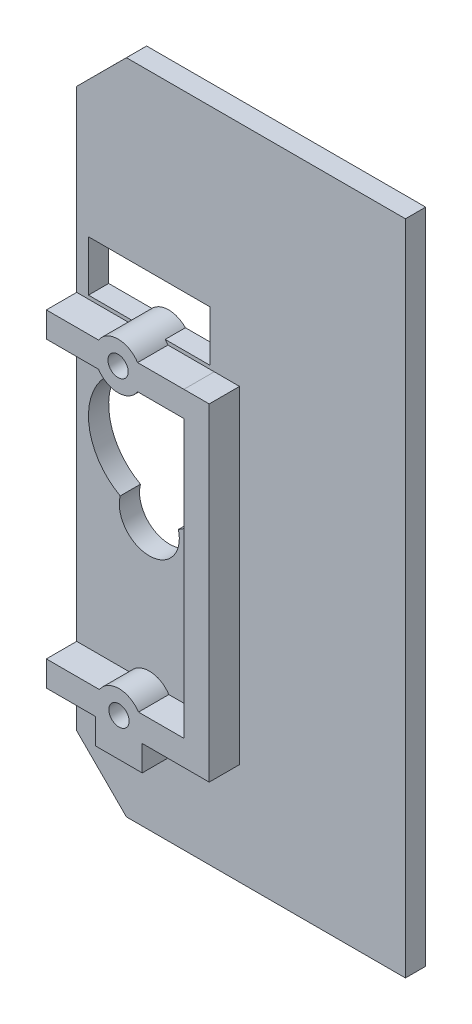
ISO-10303-21;
HEADER;
FILE_DESCRIPTION(('STEP AP214'),'2;1');
FILE_NAME('part.step','',(''),(''),'','','');
FILE_SCHEMA(('AUTOMOTIVE_DESIGN { 1 0 10303 214 1 1 1 1 }'));
ENDSEC;
DATA;
#1=APPLICATION_CONTEXT('core data for automotive mechanical design processes');
#2=APPLICATION_PROTOCOL_DEFINITION('international standard','automotive_design',2000,#1);
#3=PRODUCT_CONTEXT('',#1,'mechanical');
#4=PRODUCT('Part','Part','',(#3));
#5=PRODUCT_RELATED_PRODUCT_CATEGORY('part','',(#4));
#6=PRODUCT_DEFINITION_FORMATION('','',#4);
#7=PRODUCT_DEFINITION_CONTEXT('part definition',#1,'design');
#8=PRODUCT_DEFINITION('design','',#6,#7);
#9=PRODUCT_DEFINITION_SHAPE('','',#8);
#10=(LENGTH_UNIT() NAMED_UNIT(*) SI_UNIT(.MILLI.,.METRE.));
#11=(NAMED_UNIT(*) PLANE_ANGLE_UNIT() SI_UNIT($,.RADIAN.));
#12=(NAMED_UNIT(*) SI_UNIT($,.STERADIAN.) SOLID_ANGLE_UNIT());
#13=UNCERTAINTY_MEASURE_WITH_UNIT(LENGTH_MEASURE(1.E-05),#10,'distance_accuracy_value','');
#14=(GEOMETRIC_REPRESENTATION_CONTEXT(3) GLOBAL_UNCERTAINTY_ASSIGNED_CONTEXT((#13)) GLOBAL_UNIT_ASSIGNED_CONTEXT((#10,
#11,#12)) REPRESENTATION_CONTEXT('',''));
#15=CARTESIAN_POINT('',(0.,0.,0.));
#16=DIRECTION('',(0.,0.,1.));
#17=DIRECTION('',(1.,0.,0.));
#18=AXIS2_PLACEMENT_3D('',#15,#16,#17);
#19=CARTESIAN_POINT('',(34.653513577375,0.,0.));
#20=DIRECTION('',(-1.,0.,0.));
#21=DIRECTION('',(0.,-1.,0.));
#22=AXIS2_PLACEMENT_3D('',#19,#20,#21);
#23=PLANE('',#22);
#24=DIRECTION('',(0.,-1.,0.));
#25=VECTOR('',#24,1.);
#26=CARTESIAN_POINT('',(34.653513577375,0.,0.));
#27=LINE('',#26,#25);
#28=CARTESIAN_POINT('',(34.653513577375,67.,0.));
#29=VERTEX_POINT('',#28);
#30=CARTESIAN_POINT('',(34.653513577375,2.,0.));
#31=VERTEX_POINT('',#30);
#32=EDGE_CURVE('E532',#29,#31,#27,.T.);
#33=ORIENTED_EDGE('',*,*,#32,.F.);
#34=DIRECTION('',(0.,0.,1.));
#35=VECTOR('',#34,1.);
#36=CARTESIAN_POINT('',(34.653513577375,67.,2.));
#37=LINE('',#36,#35);
#38=CARTESIAN_POINT('',(34.653513577375,67.,2.));
#39=VERTEX_POINT('',#38);
#40=EDGE_CURVE('E11',#29,#39,#37,.T.);
#41=ORIENTED_EDGE('',*,*,#40,.T.);
#42=DIRECTION('',(0.,-1.,0.));
#43=VECTOR('',#42,1.);
#44=CARTESIAN_POINT('',(34.653513577375,0.,2.));
#45=LINE('',#44,#43);
#46=CARTESIAN_POINT('',(34.653513577375,2.,2.));
#47=VERTEX_POINT('',#46);
#48=EDGE_CURVE('E43',#39,#47,#45,.T.);
#49=ORIENTED_EDGE('',*,*,#48,.T.);
#50=DIRECTION('',(0.,0.,1.));
#51=VECTOR('',#50,1.);
#52=CARTESIAN_POINT('',(34.653513577375,2.,2.));
#53=LINE('',#52,#51);
#54=EDGE_CURVE('E38',#31,#47,#53,.T.);
#55=ORIENTED_EDGE('',*,*,#54,.F.);
#56=EDGE_LOOP('',(#33,#41,#49,#55));
#57=FACE_BOUND('',#56,.T.);
#58=ADVANCED_FACE('F35',(#57),#23,.F.);
#59=CARTESIAN_POINT('',(0.,0.,2.));
#60=DIRECTION('',(0.,0.,1.));
#61=DIRECTION('',(1.,0.,0.));
#62=AXIS2_PLACEMENT_3D('',#59,#60,#61);
#63=PLANE('',#62);
#64=ORIENTED_EDGE('',*,*,#48,.F.);
#65=DIRECTION('',(1.,0.,0.));
#66=VECTOR('',#65,1.);
#67=CARTESIAN_POINT('',(0.,67.,2.));
#68=LINE('',#67,#66);
#69=CARTESIAN_POINT('',(7.07037802273638,67.,2.));
#70=VERTEX_POINT('',#69);
#71=EDGE_CURVE('E489',#70,#39,#68,.T.);
#72=ORIENTED_EDGE('',*,*,#71,.F.);
#73=DIRECTION('',(0.707448468177643,0.706764929006177,0.));
#74=VECTOR('',#73,1.);
#75=CARTESIAN_POINT('',(-29.9682126986263,29.9971960938652,2.));
#76=LINE('',#75,#74);
#77=CARTESIAN_POINT('',(2.15351357737496,62.0878862461735,2.));
#78=VERTEX_POINT('',#77);
#79=EDGE_CURVE('E477',#78,#70,#76,.T.);
#80=ORIENTED_EDGE('',*,*,#79,.F.);
#81=DIRECTION('',(0.,-1.,0.));
#82=VECTOR('',#81,1.);
#83=CARTESIAN_POINT('',(2.15351357737497,0.,2.));
#84=LINE('',#83,#82);
#85=CARTESIAN_POINT('',(2.15351357737496,44.44849,2.));
#86=VERTEX_POINT('',#85);
#87=EDGE_CURVE('E482',#78,#86,#84,.T.);
#88=ORIENTED_EDGE('',*,*,#87,.T.);
#89=DIRECTION('',(1.,0.,0.));
#90=VECTOR('',#89,1.);
#91=CARTESIAN_POINT('',(0.,44.44849,2.));
#92=LINE('',#91,#90);
#93=CARTESIAN_POINT('',(7.3147045651056,44.44849,2.));
#94=VERTEX_POINT('',#93);
#95=EDGE_CURVE('E390',#86,#94,#92,.T.);
#96=ORIENTED_EDGE('',*,*,#95,.T.);
#97=CARTESIAN_POINT('',(9.24537802273639,43.19849,2.));
#98=DIRECTION('',(0.,0.,1.));
#99=DIRECTION('',(1.,0.,0.));
#100=AXIS2_PLACEMENT_3D('',#97,#98,#99);
#101=CIRCLE('',#100,2.30000000000001);
#102=CARTESIAN_POINT('',(7.59024431295309,44.7955286353307,2.));
#103=VERTEX_POINT('',#102);
#104=EDGE_CURVE('E280',#103,#94,#101,.T.);
#105=ORIENTED_EDGE('',*,*,#104,.F.);
#106=DIRECTION('',(1.,0.,0.));
#107=VECTOR('',#106,1.);
#108=CARTESIAN_POINT('',(3.31740423251507,44.7955286353307,2.));
#109=LINE('',#108,#107);
#110=CARTESIAN_POINT('',(3.31740423251507,44.7955286353307,2.));
#111=VERTEX_POINT('',#110);
#112=EDGE_CURVE('E260',#111,#103,#109,.T.);
#113=ORIENTED_EDGE('',*,*,#112,.F.);
#114=DIRECTION('',(0.,-1.,0.));
#115=VECTOR('',#114,1.);
#116=CARTESIAN_POINT('',(3.31740423251507,49.7955286353307,2.));
#117=LINE('',#116,#115);
#118=CARTESIAN_POINT('',(3.31740423251507,49.7955286353307,2.));
#119=VERTEX_POINT('',#118);
#120=EDGE_CURVE('E270',#119,#111,#117,.T.);
#121=ORIENTED_EDGE('',*,*,#120,.F.);
#122=DIRECTION('',(-1.,0.,0.));
#123=VECTOR('',#122,1.);
#124=CARTESIAN_POINT('',(15.3496229222349,49.7955286353307,2.));
#125=LINE('',#124,#123);
#126=CARTESIAN_POINT('',(15.3496229222349,49.7955286353307,2.));
#127=VERTEX_POINT('',#126);
#128=EDGE_CURVE('E267',#127,#119,#125,.T.);
#129=ORIENTED_EDGE('',*,*,#128,.F.);
#130=DIRECTION('',(0.,1.,0.));
#131=VECTOR('',#130,1.);
#132=CARTESIAN_POINT('',(15.3496229222349,44.7955286353307,2.));
#133=LINE('',#132,#131);
#134=CARTESIAN_POINT('',(15.3496229222349,44.7955286353307,2.));
#135=VERTEX_POINT('',#134);
#136=EDGE_CURVE('E284',#135,#127,#133,.T.);
#137=ORIENTED_EDGE('',*,*,#136,.F.);
#138=DIRECTION('',(1.,0.,0.));
#139=VECTOR('',#138,1.);
#140=CARTESIAN_POINT('',(10.9005117325197,44.7955286353307,2.));
#141=LINE('',#140,#139);
#142=CARTESIAN_POINT('',(10.9005117325197,44.7955286353307,2.));
#143=VERTEX_POINT('',#142);
#144=EDGE_CURVE('E281',#143,#135,#141,.T.);
#145=ORIENTED_EDGE('',*,*,#144,.F.);
#146=CARTESIAN_POINT('',(11.1760514803672,44.44849,2.));
#147=VERTEX_POINT('',#146);
#148=EDGE_CURVE('E391',#147,#143,#101,.T.);
#149=ORIENTED_EDGE('',*,*,#148,.F.);
#150=DIRECTION('',(1.,0.,0.));
#151=VECTOR('',#150,1.);
#152=CARTESIAN_POINT('',(0.,44.44849,2.));
#153=LINE('',#152,#151);
#154=CARTESIAN_POINT('',(15.753513577375,44.44849,2.));
#155=VERTEX_POINT('',#154);
#156=EDGE_CURVE('E388',#147,#155,#153,.T.);
#157=ORIENTED_EDGE('',*,*,#156,.T.);
#158=DIRECTION('',(0.,-1.,0.));
#159=VECTOR('',#158,1.);
#160=CARTESIAN_POINT('',(15.753513577375,0.,2.));
#161=LINE('',#160,#159);
#162=CARTESIAN_POINT('',(15.753513577375,44.45,2.));
#163=VERTEX_POINT('',#162);
#164=EDGE_CURVE('E385',#163,#155,#161,.T.);
#165=ORIENTED_EDGE('',*,*,#164,.F.);
#166=DIRECTION('',(1.,0.,0.));
#167=VECTOR('',#166,1.);
#168=CARTESIAN_POINT('',(0.,44.45,2.));
#169=LINE('',#168,#167);
#170=CARTESIAN_POINT('',(18.253513577375,44.45,2.));
#171=VERTEX_POINT('',#170);
#172=EDGE_CURVE('E383',#163,#171,#169,.T.);
#173=ORIENTED_EDGE('',*,*,#172,.T.);
#174=DIRECTION('',(0.,-1.,0.));
#175=VECTOR('',#174,1.);
#176=CARTESIAN_POINT('',(18.253513577375,0.,2.));
#177=LINE('',#176,#175);
#178=CARTESIAN_POINT('',(18.253513577375,12.07,2.));
#179=VERTEX_POINT('',#178);
#180=EDGE_CURVE('E381',#171,#179,#177,.T.);
#181=ORIENTED_EDGE('',*,*,#180,.T.);
#182=DIRECTION('',(1.,0.,0.));
#183=VECTOR('',#182,1.);
#184=CARTESIAN_POINT('',(0.,12.07,2.));
#185=LINE('',#184,#183);
#186=CARTESIAN_POINT('',(11.633513577375,12.07,2.));
#187=VERTEX_POINT('',#186);
#188=EDGE_CURVE('E378',#187,#179,#185,.T.);
#189=ORIENTED_EDGE('',*,*,#188,.F.);
#190=DIRECTION('',(0.,-1.,0.));
#191=VECTOR('',#190,1.);
#192=CARTESIAN_POINT('',(11.633513577375,0.,2.));
#193=LINE('',#192,#191);
#194=CARTESIAN_POINT('',(11.633513577375,9.54777615945103,2.));
#195=VERTEX_POINT('',#194);
#196=EDGE_CURVE('E376',#187,#195,#193,.T.);
#197=ORIENTED_EDGE('',*,*,#196,.T.);
#198=DIRECTION('',(1.,0.,0.));
#199=VECTOR('',#198,1.);
#200=CARTESIAN_POINT('',(0.,9.54777615945103,2.));
#201=LINE('',#200,#199);
#202=CARTESIAN_POINT('',(7.03351357737496,9.54777615945103,2.));
#203=VERTEX_POINT('',#202);
#204=EDGE_CURVE('E373',#203,#195,#201,.T.);
#205=ORIENTED_EDGE('',*,*,#204,.F.);
#206=DIRECTION('',(0.,-1.,0.));
#207=VECTOR('',#206,1.);
#208=CARTESIAN_POINT('',(7.03351357737496,0.,2.));
#209=LINE('',#208,#207);
#210=CARTESIAN_POINT('',(7.03351357737496,12.07,2.));
#211=VERTEX_POINT('',#210);
#212=EDGE_CURVE('E370',#211,#203,#209,.T.);
#213=ORIENTED_EDGE('',*,*,#212,.F.);
#214=DIRECTION('',(1.,0.,0.));
#215=VECTOR('',#214,1.);
#216=CARTESIAN_POINT('',(0.,12.07,2.));
#217=LINE('',#216,#215);
#218=CARTESIAN_POINT('',(2.15351357737496,12.07,2.));
#219=VERTEX_POINT('',#218);
#220=EDGE_CURVE('E367',#219,#211,#217,.T.);
#221=ORIENTED_EDGE('',*,*,#220,.F.);
#222=CARTESIAN_POINT('',(2.15351357737496,6.91686444536142,2.));
#223=VERTEX_POINT('',#222);
#224=EDGE_CURVE('E480',#219,#223,#84,.T.);
#225=ORIENTED_EDGE('',*,*,#224,.T.);
#226=DIRECTION('',(0.707106781186548,-0.707106781186548,0.));
#227=VECTOR('',#226,1.);
#228=CARTESIAN_POINT('',(4.53518901136819,4.53518901136819,2.));
#229=LINE('',#228,#227);
#230=CARTESIAN_POINT('',(7.07037802273639,2.,2.));
#231=VERTEX_POINT('',#230);
#232=EDGE_CURVE('E484',#223,#231,#229,.T.);
#233=ORIENTED_EDGE('',*,*,#232,.T.);
#234=DIRECTION('',(1.,0.,0.));
#235=VECTOR('',#234,1.);
#236=CARTESIAN_POINT('',(0.,2.,2.));
#237=LINE('',#236,#235);
#238=EDGE_CURVE('E487',#231,#47,#237,.T.);
#239=ORIENTED_EDGE('',*,*,#238,.T.);
#240=EDGE_LOOP('',(#64,#72,#80,#88,#96,#105,#113,#121,#129,#137,#145,#149,#157,#165,#173,#181,
#189,#197,#205,#213,#221,#225,#233,#239));
#241=FACE_BOUND('',#240,.T.);
#242=ADVANCED_FACE('F278',(#241),#63,.T.);
#243=CARTESIAN_POINT('',(0.,0.,0.));
#244=DIRECTION('',(0.,0.,1.));
#245=DIRECTION('',(1.,0.,0.));
#246=AXIS2_PLACEMENT_3D('',#243,#244,#245);
#247=PLANE('',#246);
#248=DIRECTION('',(1.,0.,0.));
#249=VECTOR('',#248,1.);
#250=CARTESIAN_POINT('',(0.,67.,0.));
#251=LINE('',#250,#249);
#252=CARTESIAN_POINT('',(7.07037802273638,67.,0.));
#253=VERTEX_POINT('',#252);
#254=EDGE_CURVE('E481',#253,#29,#251,.T.);
#255=ORIENTED_EDGE('',*,*,#254,.T.);
#256=ORIENTED_EDGE('',*,*,#32,.T.);
#257=DIRECTION('',(1.,0.,0.));
#258=VECTOR('',#257,1.);
#259=CARTESIAN_POINT('',(0.,2.,0.));
#260=LINE('',#259,#258);
#261=CARTESIAN_POINT('',(7.07037802273639,2.,0.));
#262=VERTEX_POINT('',#261);
#263=EDGE_CURVE('E498',#262,#31,#260,.T.);
#264=ORIENTED_EDGE('',*,*,#263,.F.);
#265=DIRECTION('',(0.707106781186548,-0.707106781186548,0.));
#266=VECTOR('',#265,1.);
#267=CARTESIAN_POINT('',(4.53518901136819,4.53518901136819,0.));
#268=LINE('',#267,#266);
#269=CARTESIAN_POINT('',(2.15351357737496,6.91686444536142,0.));
#270=VERTEX_POINT('',#269);
#271=EDGE_CURVE('E496',#270,#262,#268,.T.);
#272=ORIENTED_EDGE('',*,*,#271,.F.);
#273=DIRECTION('',(0.,-1.,0.));
#274=VECTOR('',#273,1.);
#275=CARTESIAN_POINT('',(2.15351357737497,0.,0.));
#276=LINE('',#275,#274);
#277=CARTESIAN_POINT('',(2.15351357737496,62.0878862461735,0.));
#278=VERTEX_POINT('',#277);
#279=EDGE_CURVE('E494',#278,#270,#276,.T.);
#280=ORIENTED_EDGE('',*,*,#279,.F.);
#281=DIRECTION('',(0.707448468177643,0.706764929006177,0.));
#282=VECTOR('',#281,1.);
#283=CARTESIAN_POINT('',(-29.9682126986263,29.9971960938652,0.));
#284=LINE('',#283,#282);
#285=EDGE_CURVE('E476',#278,#253,#284,.T.);
#286=ORIENTED_EDGE('',*,*,#285,.T.);
#287=EDGE_LOOP('',(#255,#256,#264,#272,#280,#286));
#288=FACE_BOUND('',#287,.T.);
#289=CARTESIAN_POINT('',(9.33351357737496,34.46374,0.));
#290=DIRECTION('',(0.,0.,1.));
#291=DIRECTION('',(1.,0.,0.));
#292=AXIS2_PLACEMENT_3D('',#289,#290,#291);
#293=CIRCLE('',#292,6.01610934485989);
#294=CARTESIAN_POINT('',(12.2086304145322,29.1791137292023,0.));
#295=VERTEX_POINT('',#294);
#296=CARTESIAN_POINT('',(6.45839674021768,29.1791137292023,0.));
#297=VERTEX_POINT('',#296);
#298=EDGE_CURVE('E394',#295,#297,#293,.T.);
#299=ORIENTED_EDGE('',*,*,#298,.T.);
#300=CARTESIAN_POINT('',(9.33351357737496,28.4476306551401,0.));
#301=DIRECTION('',(0.,0.,1.));
#302=DIRECTION('',(1.,0.,0.));
#303=AXIS2_PLACEMENT_3D('',#300,#301,#302);
#304=CIRCLE('',#303,2.96670934116316);
#305=EDGE_CURVE('E514',#297,#295,#304,.T.);
#306=ORIENTED_EDGE('',*,*,#305,.T.);
#307=EDGE_LOOP('',(#299,#306));
#308=FACE_BOUND('',#307,.T.);
#309=DIRECTION('',(-1.,0.,0.));
#310=VECTOR('',#309,1.);
#311=CARTESIAN_POINT('',(0.,49.7955286353307,0.));
#312=LINE('',#311,#310);
#313=CARTESIAN_POINT('',(15.3496229222349,49.7955286353307,0.));
#314=VERTEX_POINT('',#313);
#315=CARTESIAN_POINT('',(3.31740423251507,49.7955286353307,0.));
#316=VERTEX_POINT('',#315);
#317=EDGE_CURVE('E527',#314,#316,#312,.T.);
#318=ORIENTED_EDGE('',*,*,#317,.T.);
#319=DIRECTION('',(0.,-1.,0.));
#320=VECTOR('',#319,1.);
#321=CARTESIAN_POINT('',(3.31740423251507,0.,0.));
#322=LINE('',#321,#320);
#323=CARTESIAN_POINT('',(3.31740423251507,44.7955286353307,0.));
#324=VERTEX_POINT('',#323);
#325=EDGE_CURVE('E530',#316,#324,#322,.T.);
#326=ORIENTED_EDGE('',*,*,#325,.T.);
#327=DIRECTION('',(1.,0.,0.));
#328=VECTOR('',#327,1.);
#329=CARTESIAN_POINT('',(0.,44.7955286353307,0.));
#330=LINE('',#329,#328);
#331=CARTESIAN_POINT('',(7.5902443129531,44.7955286353307,0.));
#332=VERTEX_POINT('',#331);
#333=EDGE_CURVE('E263',#324,#332,#330,.T.);
#334=ORIENTED_EDGE('',*,*,#333,.T.);
#335=CARTESIAN_POINT('',(9.24537802273639,43.19849,0.));
#336=DIRECTION('',(0.,0.,1.));
#337=DIRECTION('',(1.,0.,0.));
#338=AXIS2_PLACEMENT_3D('',#335,#336,#337);
#339=CIRCLE('',#338,2.30000000000001);
#340=CARTESIAN_POINT('',(10.9005117325197,44.7955286353307,0.));
#341=VERTEX_POINT('',#340);
#342=EDGE_CURVE('E518',#332,#341,#339,.F.);
#343=ORIENTED_EDGE('',*,*,#342,.T.);
#344=DIRECTION('',(1.,0.,0.));
#345=VECTOR('',#344,1.);
#346=CARTESIAN_POINT('',(-1.39727422991151E-13,44.7955286353307,0.));
#347=LINE('',#346,#345);
#348=CARTESIAN_POINT('',(15.3496229222349,44.7955286353307,0.));
#349=VERTEX_POINT('',#348);
#350=EDGE_CURVE('E521',#341,#349,#347,.T.);
#351=ORIENTED_EDGE('',*,*,#350,.T.);
#352=DIRECTION('',(0.,1.,0.));
#353=VECTOR('',#352,1.);
#354=CARTESIAN_POINT('',(15.3496229222349,0.,0.));
#355=LINE('',#354,#353);
#356=EDGE_CURVE('E524',#349,#314,#355,.T.);
#357=ORIENTED_EDGE('',*,*,#356,.T.);
#358=EDGE_LOOP('',(#318,#326,#334,#343,#351,#357));
#359=FACE_BOUND('',#358,.T.);
#360=ADVANCED_FACE('F543',(#288,#308,#359),#247,.F.);
#361=CARTESIAN_POINT('',(9.33351357737496,28.4476306551401,2.));
#362=DIRECTION('',(0.,0.,1.));
#363=DIRECTION('',(1.,0.,0.));
#364=AXIS2_PLACEMENT_3D('',#361,#362,#363);
#365=CIRCLE('',#364,2.96670934116316);
#366=CARTESIAN_POINT('',(6.45839674021768,29.1791137292023,2.));
#367=VERTEX_POINT('',#366);
#368=CARTESIAN_POINT('',(12.2086304145322,29.1791137292023,2.));
#369=VERTEX_POINT('',#368);
#370=EDGE_CURVE('E299',#367,#369,#365,.T.);
#371=ORIENTED_EDGE('',*,*,#370,.F.);
#372=CARTESIAN_POINT('',(9.33351357737496,34.46374,2.));
#373=DIRECTION('',(0.,0.,1.));
#374=DIRECTION('',(1.,0.,0.));
#375=AXIS2_PLACEMENT_3D('',#372,#373,#374);
#376=CIRCLE('',#375,6.01610934485989);
#377=EDGE_CURVE('E291',#369,#367,#376,.T.);
#378=ORIENTED_EDGE('',*,*,#377,.F.);
#379=EDGE_LOOP('',(#371,#378));
#380=FACE_BOUND('',#379,.T.);
#381=CARTESIAN_POINT('',(2.15351357737496,41.94849,2.));
#382=VERTEX_POINT('',#381);
#383=CARTESIAN_POINT('',(2.15351357737496,14.57,2.));
#384=VERTEX_POINT('',#383);
#385=EDGE_CURVE('E485',#382,#384,#84,.T.);
#386=ORIENTED_EDGE('',*,*,#385,.T.);
#387=DIRECTION('',(1.,0.,0.));
#388=VECTOR('',#387,1.);
#389=CARTESIAN_POINT('',(0.,14.57,2.));
#390=LINE('',#389,#388);
#391=CARTESIAN_POINT('',(7.40284011974418,14.57,2.));
#392=VERTEX_POINT('',#391);
#393=EDGE_CURVE('E413',#384,#392,#390,.T.);
#394=ORIENTED_EDGE('',*,*,#393,.T.);
#395=CARTESIAN_POINT('',(9.33351357737496,13.32,2.));
#396=DIRECTION('',(0.,0.,1.));
#397=DIRECTION('',(1.,0.,0.));
#398=AXIS2_PLACEMENT_3D('',#395,#396,#397);
#399=CIRCLE('',#398,2.3);
#400=CARTESIAN_POINT('',(11.2641870350057,14.57,2.));
#401=VERTEX_POINT('',#400);
#402=EDGE_CURVE('E410',#401,#392,#399,.T.);
#403=ORIENTED_EDGE('',*,*,#402,.F.);
#404=DIRECTION('',(1.,0.,0.));
#405=VECTOR('',#404,1.);
#406=CARTESIAN_POINT('',(0.,14.57,2.));
#407=LINE('',#406,#405);
#408=CARTESIAN_POINT('',(15.753513577375,14.57,2.));
#409=VERTEX_POINT('',#408);
#410=EDGE_CURVE('E408',#401,#409,#407,.T.);
#411=ORIENTED_EDGE('',*,*,#410,.T.);
#412=DIRECTION('',(0.,-1.,0.));
#413=VECTOR('',#412,1.);
#414=CARTESIAN_POINT('',(15.753513577375,0.,2.));
#415=LINE('',#414,#413);
#416=CARTESIAN_POINT('',(15.753513577375,41.94849,2.));
#417=VERTEX_POINT('',#416);
#418=EDGE_CURVE('E405',#417,#409,#415,.T.);
#419=ORIENTED_EDGE('',*,*,#418,.F.);
#420=DIRECTION('',(1.,0.,0.));
#421=VECTOR('',#420,1.);
#422=CARTESIAN_POINT('',(0.,41.94849,2.));
#423=LINE('',#422,#421);
#424=CARTESIAN_POINT('',(11.1760514803672,41.94849,2.));
#425=VERTEX_POINT('',#424);
#426=EDGE_CURVE('E402',#425,#417,#423,.T.);
#427=ORIENTED_EDGE('',*,*,#426,.F.);
#428=CARTESIAN_POINT('',(9.24537802273639,43.19849,2.));
#429=DIRECTION('',(0.,0.,1.));
#430=DIRECTION('',(1.,0.,0.));
#431=AXIS2_PLACEMENT_3D('',#428,#429,#430);
#432=CIRCLE('',#431,2.30000000000001);
#433=CARTESIAN_POINT('',(7.31470456510558,41.94849,2.));
#434=VERTEX_POINT('',#433);
#435=EDGE_CURVE('E399',#434,#425,#432,.T.);
#436=ORIENTED_EDGE('',*,*,#435,.F.);
#437=DIRECTION('',(1.,0.,0.));
#438=VECTOR('',#437,1.);
#439=CARTESIAN_POINT('',(0.,41.94849,2.));
#440=LINE('',#439,#438);
#441=EDGE_CURVE('E396',#382,#434,#440,.T.);
#442=ORIENTED_EDGE('',*,*,#441,.F.);
#443=EDGE_LOOP('',(#386,#394,#403,#411,#419,#427,#436,#442));
#444=FACE_BOUND('',#443,.T.);
#445=ADVANCED_FACE('F591',(#380,#444),#63,.T.);
#446=CARTESIAN_POINT('',(9.24537802273638,43.19849,2.));
#447=DIRECTION('',(0.,0.,-1.));
#448=DIRECTION('',(-1.,0.,0.));
#449=AXIS2_PLACEMENT_3D('',#446,#447,#448);
#450=CYLINDRICAL_SURFACE('',#449,2.3);
#451=DIRECTION('',(0.,0.,-1.));
#452=VECTOR('',#451,1.);
#453=CARTESIAN_POINT('',(11.1760514803672,44.44849,5.));
#454=LINE('',#453,#452);
#455=CARTESIAN_POINT('',(11.1760514803672,44.44849,5.));
#456=VERTEX_POINT('',#455);
#457=EDGE_CURVE('E449',#456,#147,#454,.T.);
#458=ORIENTED_EDGE('',*,*,#457,.T.);
#459=ORIENTED_EDGE('',*,*,#148,.T.);
#460=DIRECTION('',(0.,0.,1.));
#461=VECTOR('',#460,1.);
#462=CARTESIAN_POINT('',(10.9005117325197,44.7955286353307,-8.));
#463=LINE('',#462,#461);
#464=EDGE_CURVE('E296',#341,#143,#463,.T.);
#465=ORIENTED_EDGE('',*,*,#464,.F.);
#466=ORIENTED_EDGE('',*,*,#342,.F.);
#467=DIRECTION('',(0.,0.,1.));
#468=VECTOR('',#467,1.);
#469=CARTESIAN_POINT('',(7.5902443129531,44.7955286353307,-8.));
#470=LINE('',#469,#468);
#471=EDGE_CURVE('E266',#332,#103,#470,.T.);
#472=ORIENTED_EDGE('',*,*,#471,.T.);
#473=ORIENTED_EDGE('',*,*,#104,.T.);
#474=DIRECTION('',(0.,0.,-1.));
#475=VECTOR('',#474,1.);
#476=CARTESIAN_POINT('',(7.3147045651056,44.44849,5.));
#477=LINE('',#476,#475);
#478=CARTESIAN_POINT('',(7.3147045651056,44.44849,5.));
#479=VERTEX_POINT('',#478);
#480=EDGE_CURVE('E446',#479,#94,#477,.T.);
#481=ORIENTED_EDGE('',*,*,#480,.F.);
#482=CARTESIAN_POINT('',(9.24537802273639,43.19849,5.));
#483=DIRECTION('',(0.,0.,1.));
#484=DIRECTION('',(1.,0.,0.));
#485=AXIS2_PLACEMENT_3D('',#482,#483,#484);
#486=CIRCLE('',#485,2.30000000000001);
#487=EDGE_CURVE('E336',#456,#479,#486,.T.);
#488=ORIENTED_EDGE('',*,*,#487,.F.);
#489=EDGE_LOOP('',(#458,#459,#465,#466,#472,#473,#481,#488));
#490=FACE_BOUND('',#489,.T.);
#491=ADVANCED_FACE('F563',(#490),#450,.T.);
#492=CARTESIAN_POINT('',(-29.9682126986263,29.9971960938652,2.));
#493=DIRECTION('',(-0.706764929006177,0.707448468177643,0.));
#494=DIRECTION('',(-0.707448468177643,-0.706764929006177,0.));
#495=AXIS2_PLACEMENT_3D('',#492,#493,#494);
#496=PLANE('',#495);
#497=ORIENTED_EDGE('',*,*,#285,.F.);
#498=DIRECTION('',(0.,0.,-1.));
#499=VECTOR('',#498,1.);
#500=CARTESIAN_POINT('',(2.15351357737496,62.0878862461735,2.));
#501=LINE('',#500,#499);
#502=EDGE_CURVE('E510',#78,#278,#501,.T.);
#503=ORIENTED_EDGE('',*,*,#502,.F.);
#504=ORIENTED_EDGE('',*,*,#79,.T.);
#505=DIRECTION('',(0.,0.,-1.));
#506=VECTOR('',#505,1.);
#507=CARTESIAN_POINT('',(7.07037802273638,67.,2.));
#508=LINE('',#507,#506);
#509=EDGE_CURVE('E491',#70,#253,#508,.T.);
#510=ORIENTED_EDGE('',*,*,#509,.T.);
#511=EDGE_LOOP('',(#497,#503,#504,#510));
#512=FACE_BOUND('',#511,.T.);
#513=ADVANCED_FACE('F550',(#512),#496,.T.);
#514=CARTESIAN_POINT('',(2.15351357737497,0.,2.));
#515=DIRECTION('',(1.,0.,0.));
#516=DIRECTION('',(0.,1.,0.));
#517=AXIS2_PLACEMENT_3D('',#514,#515,#516);
#518=PLANE('',#517);
#519=ORIENTED_EDGE('',*,*,#279,.T.);
#520=DIRECTION('',(0.,0.,-1.));
#521=VECTOR('',#520,1.);
#522=CARTESIAN_POINT('',(2.15351357737496,6.91686444536142,2.));
#523=LINE('',#522,#521);
#524=EDGE_CURVE('E507',#223,#270,#523,.T.);
#525=ORIENTED_EDGE('',*,*,#524,.F.);
#526=ORIENTED_EDGE('',*,*,#224,.F.);
#527=DIRECTION('',(0.,0.,-1.));
#528=VECTOR('',#527,1.);
#529=CARTESIAN_POINT('',(2.15351357737496,12.07,5.));
#530=LINE('',#529,#528);
#531=CARTESIAN_POINT('',(2.15351357737496,12.07,5.));
#532=VERTEX_POINT('',#531);
#533=EDGE_CURVE('E364',#532,#219,#530,.T.);
#534=ORIENTED_EDGE('',*,*,#533,.F.);
#535=DIRECTION('',(0.,-1.,0.));
#536=VECTOR('',#535,1.);
#537=CARTESIAN_POINT('',(2.15351357737497,0.,5.));
#538=LINE('',#537,#536);
#539=CARTESIAN_POINT('',(2.15351357737496,14.57,5.));
#540=VERTEX_POINT('',#539);
#541=EDGE_CURVE('E359',#540,#532,#538,.T.);
#542=ORIENTED_EDGE('',*,*,#541,.F.);
#543=DIRECTION('',(0.,0.,-1.));
#544=VECTOR('',#543,1.);
#545=CARTESIAN_POINT('',(2.15351357737496,14.57,5.));
#546=LINE('',#545,#544);
#547=EDGE_CURVE('E419',#540,#384,#546,.T.);
#548=ORIENTED_EDGE('',*,*,#547,.T.);
#549=ORIENTED_EDGE('',*,*,#385,.F.);
#550=DIRECTION('',(0.,0.,-1.));
#551=VECTOR('',#550,1.);
#552=CARTESIAN_POINT('',(2.15351357737496,41.94849,5.));
#553=LINE('',#552,#551);
#554=CARTESIAN_POINT('',(2.15351357737496,41.94849,5.));
#555=VERTEX_POINT('',#554);
#556=EDGE_CURVE('E440',#555,#382,#553,.T.);
#557=ORIENTED_EDGE('',*,*,#556,.F.);
#558=DIRECTION('',(0.,-1.,0.));
#559=VECTOR('',#558,1.);
#560=CARTESIAN_POINT('',(2.15351357737497,0.,5.));
#561=LINE('',#560,#559);
#562=CARTESIAN_POINT('',(2.15351357737496,44.44849,5.));
#563=VERTEX_POINT('',#562);
#564=EDGE_CURVE('E341',#563,#555,#561,.T.);
#565=ORIENTED_EDGE('',*,*,#564,.F.);
#566=DIRECTION('',(0.,0.,-1.));
#567=VECTOR('',#566,1.);
#568=CARTESIAN_POINT('',(2.15351357737496,44.44849,5.));
#569=LINE('',#568,#567);
#570=EDGE_CURVE('E443',#563,#86,#569,.T.);
#571=ORIENTED_EDGE('',*,*,#570,.T.);
#572=ORIENTED_EDGE('',*,*,#87,.F.);
#573=ORIENTED_EDGE('',*,*,#502,.T.);
#574=EDGE_LOOP('',(#519,#525,#526,#534,#542,#548,#549,#557,#565,#571,#572,#573));
#575=FACE_BOUND('',#574,.T.);
#576=ADVANCED_FACE('F555',(#575),#518,.F.);
#577=CARTESIAN_POINT('',(4.53518901136819,4.53518901136819,2.));
#578=DIRECTION('',(0.707106781186547,0.707106781186547,0.));
#579=DIRECTION('',(-0.707106781186548,0.707106781186548,0.));
#580=AXIS2_PLACEMENT_3D('',#577,#578,#579);
#581=PLANE('',#580);
#582=ORIENTED_EDGE('',*,*,#271,.T.);
#583=DIRECTION('',(0.,0.,-1.));
#584=VECTOR('',#583,1.);
#585=CARTESIAN_POINT('',(7.07037802273639,2.,2.));
#586=LINE('',#585,#584);
#587=EDGE_CURVE('E504',#231,#262,#586,.T.);
#588=ORIENTED_EDGE('',*,*,#587,.F.);
#589=ORIENTED_EDGE('',*,*,#232,.F.);
#590=ORIENTED_EDGE('',*,*,#524,.T.);
#591=EDGE_LOOP('',(#582,#588,#589,#590));
#592=FACE_BOUND('',#591,.T.);
#593=ADVANCED_FACE('F876',(#592),#581,.F.);
#594=CARTESIAN_POINT('',(0.,2.,2.));
#595=DIRECTION('',(0.,1.,0.));
#596=DIRECTION('',(0.,0.,1.));
#597=AXIS2_PLACEMENT_3D('',#594,#595,#596);
#598=PLANE('',#597);
#599=ORIENTED_EDGE('',*,*,#263,.T.);
#600=ORIENTED_EDGE('',*,*,#54,.T.);
#601=ORIENTED_EDGE('',*,*,#238,.F.);
#602=ORIENTED_EDGE('',*,*,#587,.T.);
#603=EDGE_LOOP('',(#599,#600,#601,#602));
#604=FACE_BOUND('',#603,.T.);
#605=ADVANCED_FACE('F539',(#604),#598,.F.);
#606=CARTESIAN_POINT('',(0.,67.,2.));
#607=DIRECTION('',(0.,1.,0.));
#608=DIRECTION('',(0.,0.,1.));
#609=AXIS2_PLACEMENT_3D('',#606,#607,#608);
#610=PLANE('',#609);
#611=ORIENTED_EDGE('',*,*,#40,.F.);
#612=ORIENTED_EDGE('',*,*,#254,.F.);
#613=ORIENTED_EDGE('',*,*,#509,.F.);
#614=ORIENTED_EDGE('',*,*,#71,.T.);
#615=EDGE_LOOP('',(#611,#612,#613,#614));
#616=FACE_BOUND('',#615,.T.);
#617=ADVANCED_FACE('F547',(#616),#610,.T.);
#618=CARTESIAN_POINT('',(0.,12.07,5.));
#619=DIRECTION('',(0.,1.,0.));
#620=DIRECTION('',(0.,0.,1.));
#621=AXIS2_PLACEMENT_3D('',#618,#619,#620);
#622=PLANE('',#621);
#623=ORIENTED_EDGE('',*,*,#220,.T.);
#624=DIRECTION('',(0.,0.,-1.));
#625=VECTOR('',#624,1.);
#626=CARTESIAN_POINT('',(7.03351357737496,12.07,5.));
#627=LINE('',#626,#625);
#628=CARTESIAN_POINT('',(7.03351357737496,12.07,5.));
#629=VERTEX_POINT('',#628);
#630=EDGE_CURVE('E473',#629,#211,#627,.T.);
#631=ORIENTED_EDGE('',*,*,#630,.F.);
#632=DIRECTION('',(1.,0.,0.));
#633=VECTOR('',#632,1.);
#634=CARTESIAN_POINT('',(0.,12.07,5.));
#635=LINE('',#634,#633);
#636=EDGE_CURVE('E312',#532,#629,#635,.T.);
#637=ORIENTED_EDGE('',*,*,#636,.F.);
#638=ORIENTED_EDGE('',*,*,#533,.T.);
#639=EDGE_LOOP('',(#623,#631,#637,#638));
#640=FACE_BOUND('',#639,.T.);
#641=ADVANCED_FACE('F629',(#640),#622,.F.);
#642=CARTESIAN_POINT('',(7.03351357737496,0.,5.));
#643=DIRECTION('',(1.,0.,0.));
#644=DIRECTION('',(0.,0.,-1.));
#645=AXIS2_PLACEMENT_3D('',#642,#643,#644);
#646=PLANE('',#645);
#647=ORIENTED_EDGE('',*,*,#212,.T.);
#648=DIRECTION('',(0.,0.,-1.));
#649=VECTOR('',#648,1.);
#650=CARTESIAN_POINT('',(7.03351357737496,9.54777615945103,5.));
#651=LINE('',#650,#649);
#652=CARTESIAN_POINT('',(7.03351357737496,9.54777615945103,5.));
#653=VERTEX_POINT('',#652);
#654=EDGE_CURVE('E470',#653,#203,#651,.T.);
#655=ORIENTED_EDGE('',*,*,#654,.F.);
#656=DIRECTION('',(0.,-1.,0.));
#657=VECTOR('',#656,1.);
#658=CARTESIAN_POINT('',(7.03351357737496,0.,5.));
#659=LINE('',#658,#657);
#660=EDGE_CURVE('E316',#629,#653,#659,.T.);
#661=ORIENTED_EDGE('',*,*,#660,.F.);
#662=ORIENTED_EDGE('',*,*,#630,.T.);
#663=EDGE_LOOP('',(#647,#655,#661,#662));
#664=FACE_BOUND('',#663,.T.);
#665=ADVANCED_FACE('F632',(#664),#646,.F.);
#666=CARTESIAN_POINT('',(0.,9.54777615945103,5.));
#667=DIRECTION('',(0.,1.,0.));
#668=DIRECTION('',(0.,0.,1.));
#669=AXIS2_PLACEMENT_3D('',#666,#667,#668);
#670=PLANE('',#669);
#671=ORIENTED_EDGE('',*,*,#204,.T.);
#672=DIRECTION('',(0.,0.,-1.));
#673=VECTOR('',#672,1.);
#674=CARTESIAN_POINT('',(11.633513577375,9.54777615945103,5.));
#675=LINE('',#674,#673);
#676=CARTESIAN_POINT('',(11.633513577375,9.54777615945103,5.));
#677=VERTEX_POINT('',#676);
#678=EDGE_CURVE('E467',#677,#195,#675,.T.);
#679=ORIENTED_EDGE('',*,*,#678,.F.);
#680=DIRECTION('',(1.,0.,0.));
#681=VECTOR('',#680,1.);
#682=CARTESIAN_POINT('',(0.,9.54777615945103,5.));
#683=LINE('',#682,#681);
#684=EDGE_CURVE('E318',#653,#677,#683,.T.);
#685=ORIENTED_EDGE('',*,*,#684,.F.);
#686=ORIENTED_EDGE('',*,*,#654,.T.);
#687=EDGE_LOOP('',(#671,#679,#685,#686));
#688=FACE_BOUND('',#687,.T.);
#689=ADVANCED_FACE('F636',(#688),#670,.F.);
#690=CARTESIAN_POINT('',(11.633513577375,0.,5.));
#691=DIRECTION('',(1.,0.,0.));
#692=DIRECTION('',(0.,0.,-1.));
#693=AXIS2_PLACEMENT_3D('',#690,#691,#692);
#694=PLANE('',#693);
#695=ORIENTED_EDGE('',*,*,#196,.F.);
#696=DIRECTION('',(0.,0.,-1.));
#697=VECTOR('',#696,1.);
#698=CARTESIAN_POINT('',(11.633513577375,12.07,5.));
#699=LINE('',#698,#697);
#700=CARTESIAN_POINT('',(11.633513577375,12.07,5.));
#701=VERTEX_POINT('',#700);
#702=EDGE_CURVE('E464',#701,#187,#699,.T.);
#703=ORIENTED_EDGE('',*,*,#702,.F.);
#704=DIRECTION('',(0.,-1.,0.));
#705=VECTOR('',#704,1.);
#706=CARTESIAN_POINT('',(11.633513577375,0.,5.));
#707=LINE('',#706,#705);
#708=EDGE_CURVE('E320',#701,#677,#707,.T.);
#709=ORIENTED_EDGE('',*,*,#708,.T.);
#710=ORIENTED_EDGE('',*,*,#678,.T.);
#711=EDGE_LOOP('',(#695,#703,#709,#710));
#712=FACE_BOUND('',#711,.T.);
#713=ADVANCED_FACE('F640',(#712),#694,.T.);
#714=CARTESIAN_POINT('',(0.,12.07,5.));
#715=DIRECTION('',(0.,1.,0.));
#716=DIRECTION('',(0.,0.,1.));
#717=AXIS2_PLACEMENT_3D('',#714,#715,#716);
#718=PLANE('',#717);
#719=ORIENTED_EDGE('',*,*,#188,.T.);
#720=DIRECTION('',(0.,0.,-1.));
#721=VECTOR('',#720,1.);
#722=CARTESIAN_POINT('',(18.253513577375,12.07,5.));
#723=LINE('',#722,#721);
#724=CARTESIAN_POINT('',(18.253513577375,12.07,5.));
#725=VERTEX_POINT('',#724);
#726=EDGE_CURVE('E461',#725,#179,#723,.T.);
#727=ORIENTED_EDGE('',*,*,#726,.F.);
#728=DIRECTION('',(1.,0.,0.));
#729=VECTOR('',#728,1.);
#730=CARTESIAN_POINT('',(0.,12.07,5.));
#731=LINE('',#730,#729);
#732=EDGE_CURVE('E323',#701,#725,#731,.T.);
#733=ORIENTED_EDGE('',*,*,#732,.F.);
#734=ORIENTED_EDGE('',*,*,#702,.T.);
#735=EDGE_LOOP('',(#719,#727,#733,#734));
#736=FACE_BOUND('',#735,.T.);
#737=ADVANCED_FACE('F644',(#736),#718,.F.);
#738=CARTESIAN_POINT('',(18.253513577375,0.,5.));
#739=DIRECTION('',(1.,0.,0.));
#740=DIRECTION('',(0.,1.,0.));
#741=AXIS2_PLACEMENT_3D('',#738,#739,#740);
#742=PLANE('',#741);
#743=ORIENTED_EDGE('',*,*,#180,.F.);
#744=DIRECTION('',(0.,0.,-1.));
#745=VECTOR('',#744,1.);
#746=CARTESIAN_POINT('',(18.253513577375,44.45,5.));
#747=LINE('',#746,#745);
#748=CARTESIAN_POINT('',(18.253513577375,44.45,5.));
#749=VERTEX_POINT('',#748);
#750=EDGE_CURVE('E458',#749,#171,#747,.T.);
#751=ORIENTED_EDGE('',*,*,#750,.F.);
#752=DIRECTION('',(0.,-1.,0.));
#753=VECTOR('',#752,1.);
#754=CARTESIAN_POINT('',(18.253513577375,0.,5.));
#755=LINE('',#754,#753);
#756=EDGE_CURVE('E325',#749,#725,#755,.T.);
#757=ORIENTED_EDGE('',*,*,#756,.T.);
#758=ORIENTED_EDGE('',*,*,#726,.T.);
#759=EDGE_LOOP('',(#743,#751,#757,#758));
#760=FACE_BOUND('',#759,.T.);
#761=ADVANCED_FACE('F648',(#760),#742,.T.);
#762=CARTESIAN_POINT('',(0.,44.45,5.));
#763=DIRECTION('',(0.,1.,0.));
#764=DIRECTION('',(0.,0.,1.));
#765=AXIS2_PLACEMENT_3D('',#762,#763,#764);
#766=PLANE('',#765);
#767=ORIENTED_EDGE('',*,*,#172,.F.);
#768=DIRECTION('',(0.,0.,-1.));
#769=VECTOR('',#768,1.);
#770=CARTESIAN_POINT('',(15.753513577375,44.45,5.));
#771=LINE('',#770,#769);
#772=CARTESIAN_POINT('',(15.753513577375,44.45,5.));
#773=VERTEX_POINT('',#772);
#774=EDGE_CURVE('E455',#773,#163,#771,.T.);
#775=ORIENTED_EDGE('',*,*,#774,.F.);
#776=DIRECTION('',(1.,0.,0.));
#777=VECTOR('',#776,1.);
#778=CARTESIAN_POINT('',(0.,44.45,5.));
#779=LINE('',#778,#777);
#780=EDGE_CURVE('E328',#773,#749,#779,.T.);
#781=ORIENTED_EDGE('',*,*,#780,.T.);
#782=ORIENTED_EDGE('',*,*,#750,.T.);
#783=EDGE_LOOP('',(#767,#775,#781,#782));
#784=FACE_BOUND('',#783,.T.);
#785=ADVANCED_FACE('F652',(#784),#766,.T.);
#786=CARTESIAN_POINT('',(15.753513577375,0.,5.));
#787=DIRECTION('',(1.,0.,0.));
#788=DIRECTION('',(0.,0.,-1.));
#789=AXIS2_PLACEMENT_3D('',#786,#787,#788);
#790=PLANE('',#789);
#791=ORIENTED_EDGE('',*,*,#164,.T.);
#792=DIRECTION('',(0.,0.,-1.));
#793=VECTOR('',#792,1.);
#794=CARTESIAN_POINT('',(15.753513577375,44.44849,5.));
#795=LINE('',#794,#793);
#796=CARTESIAN_POINT('',(15.753513577375,44.44849,5.));
#797=VERTEX_POINT('',#796);
#798=EDGE_CURVE('E452',#797,#155,#795,.T.);
#799=ORIENTED_EDGE('',*,*,#798,.F.);
#800=DIRECTION('',(0.,-1.,0.));
#801=VECTOR('',#800,1.);
#802=CARTESIAN_POINT('',(15.753513577375,0.,5.));
#803=LINE('',#802,#801);
#804=EDGE_CURVE('E331',#773,#797,#803,.T.);
#805=ORIENTED_EDGE('',*,*,#804,.F.);
#806=ORIENTED_EDGE('',*,*,#774,.T.);
#807=EDGE_LOOP('',(#791,#799,#805,#806));
#808=FACE_BOUND('',#807,.T.);
#809=ADVANCED_FACE('F656',(#808),#790,.F.);
#810=CARTESIAN_POINT('',(0.,44.44849,5.));
#811=DIRECTION('',(0.,1.,0.));
#812=DIRECTION('',(0.,0.,1.));
#813=AXIS2_PLACEMENT_3D('',#810,#811,#812);
#814=PLANE('',#813);
#815=ORIENTED_EDGE('',*,*,#156,.F.);
#816=ORIENTED_EDGE('',*,*,#457,.F.);
#817=DIRECTION('',(1.,0.,0.));
#818=VECTOR('',#817,1.);
#819=CARTESIAN_POINT('',(0.,44.44849,5.));
#820=LINE('',#819,#818);
#821=EDGE_CURVE('E333',#456,#797,#820,.T.);
#822=ORIENTED_EDGE('',*,*,#821,.T.);
#823=ORIENTED_EDGE('',*,*,#798,.T.);
#824=EDGE_LOOP('',(#815,#816,#822,#823));
#825=FACE_BOUND('',#824,.T.);
#826=ADVANCED_FACE('F660',(#825),#814,.T.);
#827=CARTESIAN_POINT('',(0.,44.44849,5.));
#828=DIRECTION('',(0.,1.,0.));
#829=DIRECTION('',(0.,0.,1.));
#830=AXIS2_PLACEMENT_3D('',#827,#828,#829);
#831=PLANE('',#830);
#832=ORIENTED_EDGE('',*,*,#95,.F.);
#833=ORIENTED_EDGE('',*,*,#570,.F.);
#834=DIRECTION('',(1.,0.,0.));
#835=VECTOR('',#834,1.);
#836=CARTESIAN_POINT('',(0.,44.44849,5.));
#837=LINE('',#836,#835);
#838=EDGE_CURVE('E338',#563,#479,#837,.T.);
#839=ORIENTED_EDGE('',*,*,#838,.T.);
#840=ORIENTED_EDGE('',*,*,#480,.T.);
#841=EDGE_LOOP('',(#832,#833,#839,#840));
#842=FACE_BOUND('',#841,.T.);
#843=ADVANCED_FACE('F559',(#842),#831,.T.);
#844=CARTESIAN_POINT('',(0.,41.94849,5.));
#845=DIRECTION('',(0.,1.,0.));
#846=DIRECTION('',(0.,0.,1.));
#847=AXIS2_PLACEMENT_3D('',#844,#845,#846);
#848=PLANE('',#847);
#849=ORIENTED_EDGE('',*,*,#441,.T.);
#850=DIRECTION('',(0.,0.,-1.));
#851=VECTOR('',#850,1.);
#852=CARTESIAN_POINT('',(7.31470456510558,41.94849,5.));
#853=LINE('',#852,#851);
#854=CARTESIAN_POINT('',(7.31470456510558,41.94849,5.));
#855=VERTEX_POINT('',#854);
#856=EDGE_CURVE('E437',#855,#434,#853,.T.);
#857=ORIENTED_EDGE('',*,*,#856,.F.);
#858=DIRECTION('',(1.,0.,0.));
#859=VECTOR('',#858,1.);
#860=CARTESIAN_POINT('',(0.,41.94849,5.));
#861=LINE('',#860,#859);
#862=EDGE_CURVE('E343',#555,#855,#861,.T.);
#863=ORIENTED_EDGE('',*,*,#862,.F.);
#864=ORIENTED_EDGE('',*,*,#556,.T.);
#865=EDGE_LOOP('',(#849,#857,#863,#864));
#866=FACE_BOUND('',#865,.T.);
#867=ADVANCED_FACE('F667',(#866),#848,.F.);
#868=CARTESIAN_POINT('',(9.24537802273639,43.19849,5.));
#869=DIRECTION('',(0.,0.,-1.));
#870=DIRECTION('',(-1.,0.,0.));
#871=AXIS2_PLACEMENT_3D('',#868,#869,#870);
#872=CYLINDRICAL_SURFACE('',#871,2.30000000000001);
#873=ORIENTED_EDGE('',*,*,#435,.T.);
#874=DIRECTION('',(0.,0.,-1.));
#875=VECTOR('',#874,1.);
#876=CARTESIAN_POINT('',(11.1760514803672,41.94849,5.));
#877=LINE('',#876,#875);
#878=CARTESIAN_POINT('',(11.1760514803672,41.94849,5.));
#879=VERTEX_POINT('',#878);
#880=EDGE_CURVE('E434',#879,#425,#877,.T.);
#881=ORIENTED_EDGE('',*,*,#880,.F.);
#882=CARTESIAN_POINT('',(9.24537802273639,43.19849,5.));
#883=DIRECTION('',(0.,0.,1.));
#884=DIRECTION('',(1.,0.,0.));
#885=AXIS2_PLACEMENT_3D('',#882,#883,#884);
#886=CIRCLE('',#885,2.30000000000001);
#887=EDGE_CURVE('E345',#855,#879,#886,.T.);
#888=ORIENTED_EDGE('',*,*,#887,.F.);
#889=ORIENTED_EDGE('',*,*,#856,.T.);
#890=EDGE_LOOP('',(#873,#881,#888,#889));
#891=FACE_BOUND('',#890,.T.);
#892=ADVANCED_FACE('F670',(#891),#872,.T.);
#893=CARTESIAN_POINT('',(0.,41.94849,5.));
#894=DIRECTION('',(0.,1.,0.));
#895=DIRECTION('',(0.,0.,1.));
#896=AXIS2_PLACEMENT_3D('',#893,#894,#895);
#897=PLANE('',#896);
#898=ORIENTED_EDGE('',*,*,#426,.T.);
#899=DIRECTION('',(0.,0.,-1.));
#900=VECTOR('',#899,1.);
#901=CARTESIAN_POINT('',(15.753513577375,41.94849,5.));
#902=LINE('',#901,#900);
#903=CARTESIAN_POINT('',(15.753513577375,41.94849,5.));
#904=VERTEX_POINT('',#903);
#905=EDGE_CURVE('E431',#904,#417,#902,.T.);
#906=ORIENTED_EDGE('',*,*,#905,.F.);
#907=DIRECTION('',(1.,0.,0.));
#908=VECTOR('',#907,1.);
#909=CARTESIAN_POINT('',(0.,41.94849,5.));
#910=LINE('',#909,#908);
#911=EDGE_CURVE('E347',#879,#904,#910,.T.);
#912=ORIENTED_EDGE('',*,*,#911,.F.);
#913=ORIENTED_EDGE('',*,*,#880,.T.);
#914=EDGE_LOOP('',(#898,#906,#912,#913));
#915=FACE_BOUND('',#914,.T.);
#916=ADVANCED_FACE('F674',(#915),#897,.F.);
#917=CARTESIAN_POINT('',(15.753513577375,0.,5.));
#918=DIRECTION('',(1.,0.,0.));
#919=DIRECTION('',(0.,1.,0.));
#920=AXIS2_PLACEMENT_3D('',#917,#918,#919);
#921=PLANE('',#920);
#922=ORIENTED_EDGE('',*,*,#418,.T.);
#923=DIRECTION('',(0.,0.,-1.));
#924=VECTOR('',#923,1.);
#925=CARTESIAN_POINT('',(15.753513577375,14.57,5.));
#926=LINE('',#925,#924);
#927=CARTESIAN_POINT('',(15.753513577375,14.57,5.));
#928=VERTEX_POINT('',#927);
#929=EDGE_CURVE('E428',#928,#409,#926,.T.);
#930=ORIENTED_EDGE('',*,*,#929,.F.);
#931=DIRECTION('',(0.,-1.,0.));
#932=VECTOR('',#931,1.);
#933=CARTESIAN_POINT('',(15.753513577375,0.,5.));
#934=LINE('',#933,#932);
#935=EDGE_CURVE('E349',#904,#928,#934,.T.);
#936=ORIENTED_EDGE('',*,*,#935,.F.);
#937=ORIENTED_EDGE('',*,*,#905,.T.);
#938=EDGE_LOOP('',(#922,#930,#936,#937));
#939=FACE_BOUND('',#938,.T.);
#940=ADVANCED_FACE('F678',(#939),#921,.F.);
#941=CARTESIAN_POINT('',(0.,14.57,5.));
#942=DIRECTION('',(0.,1.,0.));
#943=DIRECTION('',(-1.,0.,0.));
#944=AXIS2_PLACEMENT_3D('',#941,#942,#943);
#945=PLANE('',#944);
#946=ORIENTED_EDGE('',*,*,#410,.F.);
#947=DIRECTION('',(0.,0.,-1.));
#948=VECTOR('',#947,1.);
#949=CARTESIAN_POINT('',(11.2641870350057,14.57,5.));
#950=LINE('',#949,#948);
#951=CARTESIAN_POINT('',(11.2641870350057,14.57,5.));
#952=VERTEX_POINT('',#951);
#953=EDGE_CURVE('E425',#952,#401,#950,.T.);
#954=ORIENTED_EDGE('',*,*,#953,.F.);
#955=DIRECTION('',(1.,0.,0.));
#956=VECTOR('',#955,1.);
#957=CARTESIAN_POINT('',(0.,14.57,5.));
#958=LINE('',#957,#956);
#959=EDGE_CURVE('E351',#952,#928,#958,.T.);
#960=ORIENTED_EDGE('',*,*,#959,.T.);
#961=ORIENTED_EDGE('',*,*,#929,.T.);
#962=EDGE_LOOP('',(#946,#954,#960,#961));
#963=FACE_BOUND('',#962,.T.);
#964=ADVANCED_FACE('F682',(#963),#945,.T.);
#965=CARTESIAN_POINT('',(9.33351357737496,13.32,5.));
#966=DIRECTION('',(0.,0.,-1.));
#967=DIRECTION('',(-1.,0.,0.));
#968=AXIS2_PLACEMENT_3D('',#965,#966,#967);
#969=CYLINDRICAL_SURFACE('',#968,2.3);
#970=ORIENTED_EDGE('',*,*,#402,.T.);
#971=DIRECTION('',(0.,0.,-1.));
#972=VECTOR('',#971,1.);
#973=CARTESIAN_POINT('',(7.40284011974418,14.57,5.));
#974=LINE('',#973,#972);
#975=CARTESIAN_POINT('',(7.40284011974418,14.57,5.));
#976=VERTEX_POINT('',#975);
#977=EDGE_CURVE('E422',#976,#392,#974,.T.);
#978=ORIENTED_EDGE('',*,*,#977,.F.);
#979=CARTESIAN_POINT('',(9.33351357737496,13.32,5.));
#980=DIRECTION('',(0.,0.,1.));
#981=DIRECTION('',(1.,0.,0.));
#982=AXIS2_PLACEMENT_3D('',#979,#980,#981);
#983=CIRCLE('',#982,2.3);
#984=EDGE_CURVE('E354',#952,#976,#983,.T.);
#985=ORIENTED_EDGE('',*,*,#984,.F.);
#986=ORIENTED_EDGE('',*,*,#953,.T.);
#987=EDGE_LOOP('',(#970,#978,#985,#986));
#988=FACE_BOUND('',#987,.T.);
#989=ADVANCED_FACE('F625',(#988),#969,.T.);
#990=CARTESIAN_POINT('',(0.,14.57,5.));
#991=DIRECTION('',(0.,1.,0.));
#992=DIRECTION('',(0.,0.,1.));
#993=AXIS2_PLACEMENT_3D('',#990,#991,#992);
#994=PLANE('',#993);
#995=ORIENTED_EDGE('',*,*,#393,.F.);
#996=ORIENTED_EDGE('',*,*,#547,.F.);
#997=DIRECTION('',(1.,0.,0.));
#998=VECTOR('',#997,1.);
#999=CARTESIAN_POINT('',(0.,14.57,5.));
#1000=LINE('',#999,#998);
#1001=EDGE_CURVE('E356',#540,#976,#1000,.T.);
#1002=ORIENTED_EDGE('',*,*,#1001,.T.);
#1003=ORIENTED_EDGE('',*,*,#977,.T.);
#1004=EDGE_LOOP('',(#995,#996,#1002,#1003));
#1005=FACE_BOUND('',#1004,.T.);
#1006=ADVANCED_FACE('F617',(#1005),#994,.T.);
#1007=CARTESIAN_POINT('',(9.33351357737496,13.32,5.));
#1008=DIRECTION('',(0.,0.,-1.));
#1009=DIRECTION('',(-1.,0.,0.));
#1010=AXIS2_PLACEMENT_3D('',#1007,#1008,#1009);
#1011=CYLINDRICAL_SURFACE('',#1010,1.);
#1012=CARTESIAN_POINT('',(9.33351357737496,13.32,5.));
#1013=DIRECTION('',(0.,0.,1.));
#1014=DIRECTION('',(1.,0.,0.));
#1015=AXIS2_PLACEMENT_3D('',#1012,#1013,#1014);
#1016=CIRCLE('',#1015,1.);
#1017=CARTESIAN_POINT('',(10.333513577375,13.32,5.));
#1018=VERTEX_POINT('',#1017);
#1019=EDGE_CURVE('E309',#1018,#1018,#1016,.T.);
#1020=ORIENTED_EDGE('',*,*,#1019,.T.);
#1021=EDGE_LOOP('',(#1020));
#1022=FACE_BOUND('',#1021,.T.);
#1023=CARTESIAN_POINT('',(9.33351357737496,13.32,2.));
#1024=DIRECTION('',(0.,0.,1.));
#1025=DIRECTION('',(1.,0.,0.));
#1026=AXIS2_PLACEMENT_3D('',#1023,#1024,#1025);
#1027=CIRCLE('',#1026,1.);
#1028=CARTESIAN_POINT('',(10.333513577375,13.32,2.));
#1029=VERTEX_POINT('',#1028);
#1030=EDGE_CURVE('E308',#1029,#1029,#1027,.T.);
#1031=ORIENTED_EDGE('',*,*,#1030,.F.);
#1032=EDGE_LOOP('',(#1031));
#1033=FACE_BOUND('',#1032,.T.);
#1034=ADVANCED_FACE('F615',(#1022,#1033),#1011,.F.);
#1035=CARTESIAN_POINT('',(9.24537802273639,43.19849,5.));
#1036=DIRECTION('',(0.,0.,-1.));
#1037=DIRECTION('',(-1.,0.,0.));
#1038=AXIS2_PLACEMENT_3D('',#1035,#1036,#1037);
#1039=CYLINDRICAL_SURFACE('',#1038,1.);
#1040=CARTESIAN_POINT('',(9.24537802273639,43.19849,5.));
#1041=DIRECTION('',(0.,0.,1.));
#1042=DIRECTION('',(1.,0.,0.));
#1043=AXIS2_PLACEMENT_3D('',#1040,#1041,#1042);
#1044=CIRCLE('',#1043,1.);
#1045=CARTESIAN_POINT('',(10.2453780227364,43.19849,5.));
#1046=VERTEX_POINT('',#1045);
#1047=EDGE_CURVE('E361',#1046,#1046,#1044,.T.);
#1048=ORIENTED_EDGE('',*,*,#1047,.T.);
#1049=EDGE_LOOP('',(#1048));
#1050=FACE_BOUND('',#1049,.T.);
#1051=CARTESIAN_POINT('',(9.24537802273639,43.19849,2.));
#1052=DIRECTION('',(0.,0.,1.));
#1053=DIRECTION('',(1.,0.,0.));
#1054=AXIS2_PLACEMENT_3D('',#1051,#1052,#1053);
#1055=CIRCLE('',#1054,1.);
#1056=CARTESIAN_POINT('',(10.2453780227364,43.19849,2.));
#1057=VERTEX_POINT('',#1056);
#1058=EDGE_CURVE('E313',#1057,#1057,#1055,.T.);
#1059=ORIENTED_EDGE('',*,*,#1058,.F.);
#1060=EDGE_LOOP('',(#1059));
#1061=FACE_BOUND('',#1060,.T.);
#1062=ADVANCED_FACE('F610',(#1050,#1061),#1039,.F.);
#1063=CARTESIAN_POINT('',(0.,0.,5.));
#1064=DIRECTION('',(0.,0.,1.));
#1065=DIRECTION('',(1.,0.,0.));
#1066=AXIS2_PLACEMENT_3D('',#1063,#1064,#1065);
#1067=PLANE('',#1066);
#1068=ORIENTED_EDGE('',*,*,#1019,.F.);
#1069=EDGE_LOOP('',(#1068));
#1070=FACE_BOUND('',#1069,.T.);
#1071=ORIENTED_EDGE('',*,*,#636,.T.);
#1072=ORIENTED_EDGE('',*,*,#660,.T.);
#1073=ORIENTED_EDGE('',*,*,#684,.T.);
#1074=ORIENTED_EDGE('',*,*,#708,.F.);
#1075=ORIENTED_EDGE('',*,*,#732,.T.);
#1076=ORIENTED_EDGE('',*,*,#756,.F.);
#1077=ORIENTED_EDGE('',*,*,#780,.F.);
#1078=ORIENTED_EDGE('',*,*,#804,.T.);
#1079=ORIENTED_EDGE('',*,*,#821,.F.);
#1080=ORIENTED_EDGE('',*,*,#487,.T.);
#1081=ORIENTED_EDGE('',*,*,#838,.F.);
#1082=ORIENTED_EDGE('',*,*,#564,.T.);
#1083=ORIENTED_EDGE('',*,*,#862,.T.);
#1084=ORIENTED_EDGE('',*,*,#887,.T.);
#1085=ORIENTED_EDGE('',*,*,#911,.T.);
#1086=ORIENTED_EDGE('',*,*,#935,.T.);
#1087=ORIENTED_EDGE('',*,*,#959,.F.);
#1088=ORIENTED_EDGE('',*,*,#984,.T.);
#1089=ORIENTED_EDGE('',*,*,#1001,.F.);
#1090=ORIENTED_EDGE('',*,*,#541,.T.);
#1091=EDGE_LOOP('',(#1071,#1072,#1073,#1074,#1075,#1076,#1077,#1078,#1079,#1080,#1081,#1082,
#1083,#1084,#1085,#1086,#1087,#1088,#1089,#1090));
#1092=FACE_BOUND('',#1091,.T.);
#1093=ORIENTED_EDGE('',*,*,#1047,.F.);
#1094=EDGE_LOOP('',(#1093));
#1095=FACE_BOUND('',#1094,.T.);
#1096=ADVANCED_FACE('F602',(#1070,#1092,#1095),#1067,.T.);
#1097=ORIENTED_EDGE('',*,*,#1030,.T.);
#1098=EDGE_LOOP('',(#1097));
#1099=FACE_BOUND('',#1098,.T.);
#1100=ADVANCED_FACE('F592',(#1099),#63,.T.);
#1101=ORIENTED_EDGE('',*,*,#1058,.T.);
#1102=EDGE_LOOP('',(#1101));
#1103=FACE_BOUND('',#1102,.T.);
#1104=ADVANCED_FACE('F600',(#1103),#63,.T.);
#1105=CARTESIAN_POINT('',(9.33351357737496,28.4476306551401,-1.));
#1106=DIRECTION('',(0.,0.,1.));
#1107=DIRECTION('',(1.,0.,0.));
#1108=AXIS2_PLACEMENT_3D('',#1105,#1106,#1107);
#1109=CYLINDRICAL_SURFACE('',#1108,2.96670934116316);
#1110=DIRECTION('',(0.,0.,1.));
#1111=VECTOR('',#1110,1.);
#1112=CARTESIAN_POINT('',(6.45839674021768,29.1791137292023,0.5));
#1113=LINE('',#1112,#1111);
#1114=EDGE_CURVE('E306',#297,#367,#1113,.T.);
#1115=ORIENTED_EDGE('',*,*,#1114,.T.);
#1116=ORIENTED_EDGE('',*,*,#370,.T.);
#1117=DIRECTION('',(0.,0.,1.));
#1118=VECTOR('',#1117,1.);
#1119=CARTESIAN_POINT('',(12.2086304145322,29.1791137292023,0.5));
#1120=LINE('',#1119,#1118);
#1121=EDGE_CURVE('E301',#369,#295,#1120,.F.);
#1122=ORIENTED_EDGE('',*,*,#1121,.T.);
#1123=ORIENTED_EDGE('',*,*,#305,.F.);
#1124=EDGE_LOOP('',(#1115,#1116,#1122,#1123));
#1125=FACE_BOUND('',#1124,.T.);
#1126=ADVANCED_FACE('F608',(#1125),#1109,.F.);
#1127=CARTESIAN_POINT('',(9.33351357737496,34.46374,-1.));
#1128=DIRECTION('',(0.,0.,1.));
#1129=DIRECTION('',(1.,0.,0.));
#1130=AXIS2_PLACEMENT_3D('',#1127,#1128,#1129);
#1131=CYLINDRICAL_SURFACE('',#1130,6.01610934485989);
#1132=ORIENTED_EDGE('',*,*,#1121,.F.);
#1133=ORIENTED_EDGE('',*,*,#377,.T.);
#1134=ORIENTED_EDGE('',*,*,#1114,.F.);
#1135=ORIENTED_EDGE('',*,*,#298,.F.);
#1136=EDGE_LOOP('',(#1132,#1133,#1134,#1135));
#1137=FACE_BOUND('',#1136,.T.);
#1138=ADVANCED_FACE('F690',(#1137),#1131,.F.);
#1139=CARTESIAN_POINT('',(3.31740423251507,49.7955286353307,-8.));
#1140=DIRECTION('',(-1.,0.,0.));
#1141=DIRECTION('',(0.,0.,1.));
#1142=AXIS2_PLACEMENT_3D('',#1139,#1140,#1141);
#1143=PLANE('',#1142);
#1144=DIRECTION('',(0.,0.,1.));
#1145=VECTOR('',#1144,1.);
#1146=CARTESIAN_POINT('',(3.31740423251507,49.7955286353307,-8.));
#1147=LINE('',#1146,#1145);
#1148=EDGE_CURVE('E273',#316,#119,#1147,.T.);
#1149=ORIENTED_EDGE('',*,*,#1148,.T.);
#1150=ORIENTED_EDGE('',*,*,#120,.T.);
#1151=DIRECTION('',(0.,0.,1.));
#1152=VECTOR('',#1151,1.);
#1153=CARTESIAN_POINT('',(3.31740423251507,44.7955286353307,-8.));
#1154=LINE('',#1153,#1152);
#1155=EDGE_CURVE('E256',#324,#111,#1154,.T.);
#1156=ORIENTED_EDGE('',*,*,#1155,.F.);
#1157=ORIENTED_EDGE('',*,*,#325,.F.);
#1158=EDGE_LOOP('',(#1149,#1150,#1156,#1157));
#1159=FACE_BOUND('',#1158,.T.);
#1160=ADVANCED_FACE('F271',(#1159),#1143,.F.);
#1161=CARTESIAN_POINT('',(15.3496229222349,49.7955286353307,-8.));
#1162=DIRECTION('',(0.,1.,0.));
#1163=DIRECTION('',(0.,0.,1.));
#1164=AXIS2_PLACEMENT_3D('',#1161,#1162,#1163);
#1165=PLANE('',#1164);
#1166=DIRECTION('',(0.,0.,1.));
#1167=VECTOR('',#1166,1.);
#1168=CARTESIAN_POINT('',(15.3496229222349,49.7955286353307,-8.));
#1169=LINE('',#1168,#1167);
#1170=EDGE_CURVE('E292',#314,#127,#1169,.T.);
#1171=ORIENTED_EDGE('',*,*,#1170,.T.);
#1172=ORIENTED_EDGE('',*,*,#128,.T.);
#1173=ORIENTED_EDGE('',*,*,#1148,.F.);
#1174=ORIENTED_EDGE('',*,*,#317,.F.);
#1175=EDGE_LOOP('',(#1171,#1172,#1173,#1174));
#1176=FACE_BOUND('',#1175,.T.);
#1177=ADVANCED_FACE('F569',(#1176),#1165,.F.);
#1178=CARTESIAN_POINT('',(15.3496229222349,44.7955286353307,-8.));
#1179=DIRECTION('',(1.,0.,0.));
#1180=DIRECTION('',(0.,0.,-1.));
#1181=AXIS2_PLACEMENT_3D('',#1178,#1179,#1180);
#1182=PLANE('',#1181);
#1183=DIRECTION('',(0.,0.,1.));
#1184=VECTOR('',#1183,1.);
#1185=CARTESIAN_POINT('',(15.3496229222349,44.7955286353307,-8.));
#1186=LINE('',#1185,#1184);
#1187=EDGE_CURVE('E294',#349,#135,#1186,.T.);
#1188=ORIENTED_EDGE('',*,*,#1187,.T.);
#1189=ORIENTED_EDGE('',*,*,#136,.T.);
#1190=ORIENTED_EDGE('',*,*,#1170,.F.);
#1191=ORIENTED_EDGE('',*,*,#356,.F.);
#1192=EDGE_LOOP('',(#1188,#1189,#1190,#1191));
#1193=FACE_BOUND('',#1192,.T.);
#1194=ADVANCED_FACE('F574',(#1193),#1182,.F.);
#1195=CARTESIAN_POINT('',(10.9005117325197,44.7955286353307,-8.));
#1196=DIRECTION('',(0.,-1.,0.));
#1197=DIRECTION('',(1.,0.,0.));
#1198=AXIS2_PLACEMENT_3D('',#1195,#1196,#1197);
#1199=PLANE('',#1198);
#1200=ORIENTED_EDGE('',*,*,#464,.T.);
#1201=ORIENTED_EDGE('',*,*,#144,.T.);
#1202=ORIENTED_EDGE('',*,*,#1187,.F.);
#1203=ORIENTED_EDGE('',*,*,#350,.F.);
#1204=EDGE_LOOP('',(#1200,#1201,#1202,#1203));
#1205=FACE_BOUND('',#1204,.T.);
#1206=ADVANCED_FACE('F577',(#1205),#1199,.F.);
#1207=CARTESIAN_POINT('',(3.31740423251507,44.7955286353307,-8.));
#1208=DIRECTION('',(0.,-1.,0.));
#1209=DIRECTION('',(0.,0.,-1.));
#1210=AXIS2_PLACEMENT_3D('',#1207,#1208,#1209);
#1211=PLANE('',#1210);
#1212=ORIENTED_EDGE('',*,*,#1155,.T.);
#1213=ORIENTED_EDGE('',*,*,#112,.T.);
#1214=ORIENTED_EDGE('',*,*,#471,.F.);
#1215=ORIENTED_EDGE('',*,*,#333,.F.);
#1216=EDGE_LOOP('',(#1212,#1213,#1214,#1215));
#1217=FACE_BOUND('',#1216,.T.);
#1218=ADVANCED_FACE('F258',(#1217),#1211,.F.);
#1219=CLOSED_SHELL('',(#58,#242,#360,#445,#491,#513,#576,#593,#605,#617,#641,#665,#689,#713,
#737,#761,#785,#809,#826,#843,#867,#892,#916,#940,#964,#989,#1006,#1034,#1062,#1096,#1100,#1104,
#1126,#1138,#1160,#1177,#1194,#1206,#1218));
#1220=MANIFOLD_SOLID_BREP('B2',#1219);
#1221=ADVANCED_BREP_SHAPE_REPRESENTATION('',(#18,#1220),#14);
#1222=SHAPE_DEFINITION_REPRESENTATION(#9,#1221);
ENDSEC;
END-ISO-10303-21;
